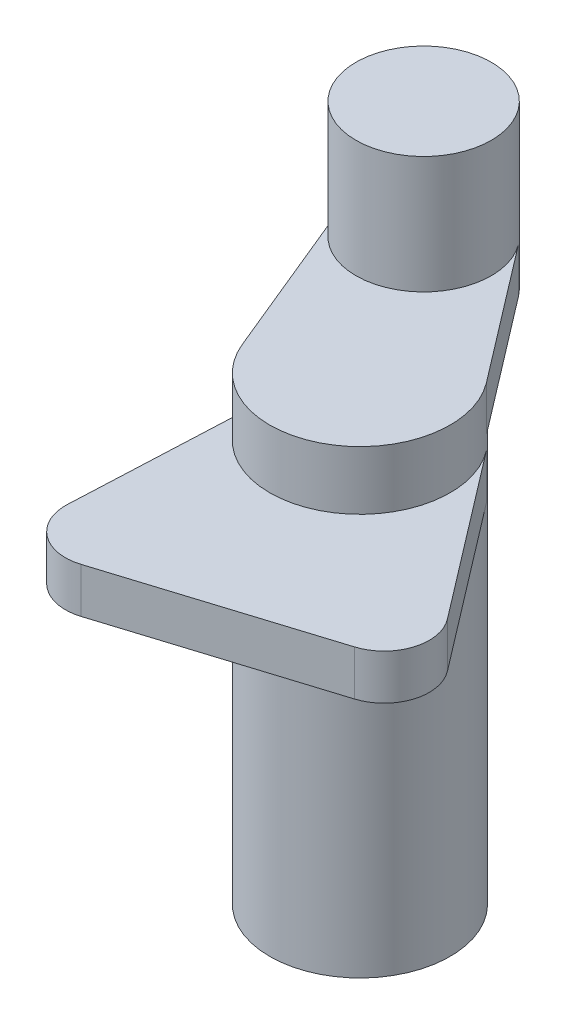
ISO-10303-21;
HEADER;
FILE_DESCRIPTION(('STEP AP214'),'2;1');
FILE_NAME('part.step','',(''),(''),'','','');
FILE_SCHEMA(('AUTOMOTIVE_DESIGN { 1 0 10303 214 1 1 1 1 }'));
ENDSEC;
DATA;
#1=APPLICATION_CONTEXT('core data for automotive mechanical design processes');
#2=APPLICATION_PROTOCOL_DEFINITION('international standard','automotive_design',2000,#1);
#3=PRODUCT_CONTEXT('',#1,'mechanical');
#4=PRODUCT('Part','Part','',(#3));
#5=PRODUCT_RELATED_PRODUCT_CATEGORY('part','',(#4));
#6=PRODUCT_DEFINITION_FORMATION('','',#4);
#7=PRODUCT_DEFINITION_CONTEXT('part definition',#1,'design');
#8=PRODUCT_DEFINITION('design','',#6,#7);
#9=PRODUCT_DEFINITION_SHAPE('','',#8);
#10=(LENGTH_UNIT() NAMED_UNIT(*) SI_UNIT(.MILLI.,.METRE.));
#11=(NAMED_UNIT(*) PLANE_ANGLE_UNIT() SI_UNIT($,.RADIAN.));
#12=(NAMED_UNIT(*) SI_UNIT($,.STERADIAN.) SOLID_ANGLE_UNIT());
#13=UNCERTAINTY_MEASURE_WITH_UNIT(LENGTH_MEASURE(1.E-05),#10,'distance_accuracy_value','');
#14=(GEOMETRIC_REPRESENTATION_CONTEXT(3) GLOBAL_UNCERTAINTY_ASSIGNED_CONTEXT((#13)) GLOBAL_UNIT_ASSIGNED_CONTEXT((#10,
#11,#12)) REPRESENTATION_CONTEXT('',''));
#15=CARTESIAN_POINT('',(0.,0.,0.));
#16=DIRECTION('',(0.,0.,1.));
#17=DIRECTION('',(1.,0.,0.));
#18=AXIS2_PLACEMENT_3D('',#15,#16,#17);
#19=CARTESIAN_POINT('',(0.,51.,0.));
#20=DIRECTION('',(0.,-1.,0.));
#21=DIRECTION('',(0.,0.,-1.));
#22=AXIS2_PLACEMENT_3D('',#19,#20,#21);
#23=CYLINDRICAL_SURFACE('',#22,20.);
#24=CARTESIAN_POINT('',(0.,41.,0.));
#25=DIRECTION('',(0.,1.,0.));
#26=DIRECTION('',(0.,0.,1.));
#27=AXIS2_PLACEMENT_3D('',#24,#25,#26);
#28=CIRCLE('',#27,20.);
#29=CARTESIAN_POINT('',(15.8895303252354,41.,-12.1458974984735));
#30=VERTEX_POINT('',#29);
#31=CARTESIAN_POINT('',(-18.4916973012162,41.,7.61952301133037));
#32=VERTEX_POINT('',#31);
#33=EDGE_CURVE('E48',#30,#32,#28,.T.);
#34=ORIENTED_EDGE('',*,*,#33,.F.);
#35=DIRECTION('',(0.,1.,0.));
#36=VECTOR('',#35,1.);
#37=CARTESIAN_POINT('',(15.8895303252354,41.,-12.1458974984735));
#38=LINE('',#37,#36);
#39=CARTESIAN_POINT('',(15.8895303252354,51.,-12.1458974984735));
#40=VERTEX_POINT('',#39);
#41=EDGE_CURVE('E224',#30,#40,#38,.T.);
#42=ORIENTED_EDGE('',*,*,#41,.T.);
#43=CARTESIAN_POINT('',(0.,51.,0.));
#44=DIRECTION('',(0.,1.,0.));
#45=DIRECTION('',(0.,0.,1.));
#46=AXIS2_PLACEMENT_3D('',#43,#44,#45);
#47=CIRCLE('',#46,20.);
#48=CARTESIAN_POINT('',(-18.4916973012162,51.,7.61952301133037));
#49=VERTEX_POINT('',#48);
#50=EDGE_CURVE('E234',#49,#40,#47,.T.);
#51=ORIENTED_EDGE('',*,*,#50,.F.);
#52=DIRECTION('',(0.,1.,0.));
#53=VECTOR('',#52,1.);
#54=CARTESIAN_POINT('',(-18.4916973012162,41.,7.61952301133037));
#55=LINE('',#54,#53);
#56=EDGE_CURVE('E228',#32,#49,#55,.T.);
#57=ORIENTED_EDGE('',*,*,#56,.F.);
#58=EDGE_LOOP('',(#34,#42,#51,#57));
#59=FACE_BOUND('',#58,.T.);
#60=CARTESIAN_POINT('',(0.,-51.,0.));
#61=DIRECTION('',(0.,1.,0.));
#62=DIRECTION('',(0.,0.,1.));
#63=AXIS2_PLACEMENT_3D('',#60,#61,#62);
#64=CIRCLE('',#63,20.);
#65=CARTESIAN_POINT('',(0.,-51.,20.));
#66=VERTEX_POINT('',#65);
#67=EDGE_CURVE('E223',#66,#66,#64,.T.);
#68=ORIENTED_EDGE('',*,*,#67,.T.);
#69=EDGE_LOOP('',(#68));
#70=FACE_BOUND('',#69,.T.);
#71=CARTESIAN_POINT('',(0.,38.,0.));
#72=DIRECTION('',(0.,1.,0.));
#73=DIRECTION('',(0.,0.,-1.));
#74=AXIS2_PLACEMENT_3D('',#71,#72,#73);
#75=CIRCLE('',#74,20.);
#76=CARTESIAN_POINT('',(-18.4916973012162,38.,7.61952301133037));
#77=VERTEX_POINT('',#76);
#78=CARTESIAN_POINT('',(15.8895303252354,38.,-12.1458974984735));
#79=VERTEX_POINT('',#78);
#80=EDGE_CURVE('E143',#77,#79,#75,.T.);
#81=ORIENTED_EDGE('',*,*,#80,.T.);
#82=DIRECTION('',(0.,-1.,0.));
#83=VECTOR('',#82,1.);
#84=CARTESIAN_POINT('',(15.8895303252354,38.,-12.1458974984735));
#85=LINE('',#84,#83);
#86=CARTESIAN_POINT('',(15.8895303252354,28.,-12.1458974984735));
#87=VERTEX_POINT('',#86);
#88=EDGE_CURVE('E126',#79,#87,#85,.T.);
#89=ORIENTED_EDGE('',*,*,#88,.T.);
#90=CARTESIAN_POINT('',(0.,28.,0.));
#91=DIRECTION('',(0.,1.,0.));
#92=DIRECTION('',(0.,0.,-1.));
#93=AXIS2_PLACEMENT_3D('',#90,#91,#92);
#94=CIRCLE('',#93,20.);
#95=CARTESIAN_POINT('',(-18.4916973012162,28.,7.61952301133037));
#96=VERTEX_POINT('',#95);
#97=EDGE_CURVE('E170',#96,#87,#94,.T.);
#98=ORIENTED_EDGE('',*,*,#97,.F.);
#99=DIRECTION('',(0.,-1.,0.));
#100=VECTOR('',#99,1.);
#101=CARTESIAN_POINT('',(-18.4916973012162,38.,7.61952301133037));
#102=LINE('',#101,#100);
#103=EDGE_CURVE('E151',#77,#96,#102,.T.);
#104=ORIENTED_EDGE('',*,*,#103,.F.);
#105=EDGE_LOOP('',(#81,#89,#98,#104));
#106=FACE_BOUND('',#105,.T.);
#107=ADVANCED_FACE('F45',(#59,#70,#106),#23,.T.);
#108=CARTESIAN_POINT('',(0.,51.,0.));
#109=DIRECTION('',(0.,1.,0.));
#110=DIRECTION('',(0.,0.,1.));
#111=AXIS2_PLACEMENT_3D('',#108,#109,#110);
#112=PLANE('',#111);
#113=CARTESIAN_POINT('',(-19.0919301378831,51.,-33.2097157039126));
#114=DIRECTION('',(0.,1.,0.));
#115=DIRECTION('',(0.,0.,1.));
#116=AXIS2_PLACEMENT_3D('',#113,#114,#115);
#117=CIRCLE('',#116,15.);
#118=CARTESIAN_POINT('',(-32.9607031137953,51.,-27.4950734454149));
#119=VERTEX_POINT('',#118);
#120=CARTESIAN_POINT('',(-7.17478239395661,51.,-42.3191388277678));
#121=VERTEX_POINT('',#120);
#122=EDGE_CURVE('E11',#119,#121,#117,.T.);
#123=ORIENTED_EDGE('',*,*,#122,.F.);
#124=DIRECTION('',(0.380976150566519,0.,0.924584865060811));
#125=VECTOR('',#124,1.);
#126=CARTESIAN_POINT('',(-18.4916973012162,51.,7.61952301133037));
#127=LINE('',#126,#125);
#128=EDGE_CURVE('E69',#119,#49,#127,.T.);
#129=ORIENTED_EDGE('',*,*,#128,.T.);
#130=ORIENTED_EDGE('',*,*,#50,.T.);
#131=DIRECTION('',(0.607294874923676,0.,0.794476516261769));
#132=VECTOR('',#131,1.);
#133=CARTESIAN_POINT('',(15.8895303252354,51.,-12.1458974984735));
#134=LINE('',#133,#132);
#135=EDGE_CURVE('E207',#121,#40,#134,.T.);
#136=ORIENTED_EDGE('',*,*,#135,.F.);
#137=EDGE_LOOP('',(#123,#129,#130,#136));
#138=FACE_BOUND('',#137,.T.);
#139=ADVANCED_FACE('F244',(#138),#112,.T.);
#140=CARTESIAN_POINT('',(0.,-51.,0.));
#141=DIRECTION('',(0.,1.,0.));
#142=DIRECTION('',(0.,0.,1.));
#143=AXIS2_PLACEMENT_3D('',#140,#141,#142);
#144=PLANE('',#143);
#145=ORIENTED_EDGE('',*,*,#67,.F.);
#146=EDGE_LOOP('',(#145));
#147=FACE_BOUND('',#146,.T.);
#148=ADVANCED_FACE('F241',(#147),#144,.F.);
#149=CARTESIAN_POINT('',(0.,41.,0.));
#150=DIRECTION('',(0.,1.,0.));
#151=DIRECTION('',(0.,0.,1.));
#152=AXIS2_PLACEMENT_3D('',#149,#150,#151);
#153=PLANE('',#152);
#154=DIRECTION('',(0.607294874923676,0.,0.794476516261769));
#155=VECTOR('',#154,1.);
#156=CARTESIAN_POINT('',(15.8895303252354,41.,-12.1458974984735));
#157=LINE('',#156,#155);
#158=CARTESIAN_POINT('',(-7.17478239395661,41.,-42.3191388277678));
#159=VERTEX_POINT('',#158);
#160=EDGE_CURVE('E211',#159,#30,#157,.T.);
#161=ORIENTED_EDGE('',*,*,#160,.T.);
#162=ORIENTED_EDGE('',*,*,#33,.T.);
#163=DIRECTION('',(0.380976150566519,0.,0.924584865060811));
#164=VECTOR('',#163,1.);
#165=CARTESIAN_POINT('',(-18.4916973012162,41.,7.61952301133037));
#166=LINE('',#165,#164);
#167=CARTESIAN_POINT('',(-32.9607031137953,41.,-27.4950734454149));
#168=VERTEX_POINT('',#167);
#169=EDGE_CURVE('E206',#168,#32,#166,.T.);
#170=ORIENTED_EDGE('',*,*,#169,.F.);
#171=CARTESIAN_POINT('',(-19.0919301378831,41.,-33.2097157039126));
#172=DIRECTION('',(0.,1.,0.));
#173=DIRECTION('',(0.,0.,1.));
#174=AXIS2_PLACEMENT_3D('',#171,#172,#173);
#175=CIRCLE('',#174,15.);
#176=EDGE_CURVE('E202',#159,#168,#175,.T.);
#177=ORIENTED_EDGE('',*,*,#176,.F.);
#178=EDGE_LOOP('',(#161,#162,#170,#177));
#179=FACE_BOUND('',#178,.T.);
#180=ADVANCED_FACE('F243',(#179),#153,.F.);
#181=CARTESIAN_POINT('',(-19.0919301378831,41.,-33.2097157039126));
#182=DIRECTION('',(0.,1.,0.));
#183=DIRECTION('',(0.,0.,1.));
#184=AXIS2_PLACEMENT_3D('',#181,#182,#183);
#185=CYLINDRICAL_SURFACE('',#184,15.);
#186=DIRECTION('',(0.,1.,0.));
#187=VECTOR('',#186,1.);
#188=CARTESIAN_POINT('',(-32.9607031137953,41.,-27.4950734454149));
#189=LINE('',#188,#187);
#190=EDGE_CURVE('E214',#168,#119,#189,.T.);
#191=ORIENTED_EDGE('',*,*,#190,.T.);
#192=ORIENTED_EDGE('',*,*,#122,.T.);
#193=DIRECTION('',(0.,1.,0.));
#194=VECTOR('',#193,1.);
#195=CARTESIAN_POINT('',(-7.17478239395661,41.,-42.3191388277678));
#196=LINE('',#195,#194);
#197=EDGE_CURVE('E219',#159,#121,#196,.T.);
#198=ORIENTED_EDGE('',*,*,#197,.F.);
#199=ORIENTED_EDGE('',*,*,#176,.T.);
#200=EDGE_LOOP('',(#191,#192,#198,#199));
#201=FACE_BOUND('',#200,.T.);
#202=CARTESIAN_POINT('',(-19.0919301378831,77.,-33.2097157039126));
#203=DIRECTION('',(0.,1.,0.));
#204=DIRECTION('',(0.,0.,1.));
#205=AXIS2_PLACEMENT_3D('',#202,#203,#204);
#206=CIRCLE('',#205,15.);
#207=CARTESIAN_POINT('',(-19.0919301378831,77.,-18.2097157039126));
#208=VERTEX_POINT('',#207);
#209=EDGE_CURVE('E187',#208,#208,#206,.T.);
#210=ORIENTED_EDGE('',*,*,#209,.F.);
#211=EDGE_LOOP('',(#210));
#212=FACE_BOUND('',#211,.T.);
#213=ADVANCED_FACE('F249',(#201,#212),#185,.T.);
#214=CARTESIAN_POINT('',(15.8895303252354,41.,-12.1458974984735));
#215=DIRECTION('',(-0.794476516261769,0.,0.607294874923676));
#216=DIRECTION('',(0.607294874923676,0.,0.794476516261769));
#217=AXIS2_PLACEMENT_3D('',#214,#215,#216);
#218=PLANE('',#217);
#219=ORIENTED_EDGE('',*,*,#135,.T.);
#220=ORIENTED_EDGE('',*,*,#41,.F.);
#221=ORIENTED_EDGE('',*,*,#160,.F.);
#222=ORIENTED_EDGE('',*,*,#197,.T.);
#223=EDGE_LOOP('',(#219,#220,#221,#222));
#224=FACE_BOUND('',#223,.T.);
#225=ADVANCED_FACE('F270',(#224),#218,.F.);
#226=CARTESIAN_POINT('',(-18.4916973012162,41.,7.61952301133037));
#227=DIRECTION('',(-0.924584865060811,0.,0.380976150566519));
#228=DIRECTION('',(0.380976150566519,0.,0.924584865060811));
#229=AXIS2_PLACEMENT_3D('',#226,#227,#228);
#230=PLANE('',#229);
#231=ORIENTED_EDGE('',*,*,#128,.F.);
#232=ORIENTED_EDGE('',*,*,#190,.F.);
#233=ORIENTED_EDGE('',*,*,#169,.T.);
#234=ORIENTED_EDGE('',*,*,#56,.T.);
#235=EDGE_LOOP('',(#231,#232,#233,#234));
#236=FACE_BOUND('',#235,.T.);
#237=ADVANCED_FACE('F266',(#236),#230,.T.);
#238=CARTESIAN_POINT('',(0.,77.,0.));
#239=DIRECTION('',(0.,1.,0.));
#240=DIRECTION('',(0.,0.,1.));
#241=AXIS2_PLACEMENT_3D('',#238,#239,#240);
#242=PLANE('',#241);
#243=ORIENTED_EDGE('',*,*,#209,.T.);
#244=EDGE_LOOP('',(#243));
#245=FACE_BOUND('',#244,.T.);
#246=ADVANCED_FACE('F277',(#245),#242,.T.);
#247=CARTESIAN_POINT('',(-18.4916973012162,38.,7.61952301133037));
#248=DIRECTION('',(-0.998965941497928,0.,-0.0454647965700774));
#249=DIRECTION('',(-0.0454647965700775,0.,0.998965941497928));
#250=AXIS2_PLACEMENT_3D('',#247,#248,#249);
#251=PLANE('',#250);
#252=DIRECTION('',(0.0454647965700774,0.,-0.998965941497928));
#253=VECTOR('',#252,1.);
#254=CARTESIAN_POINT('',(-18.4916973012162,28.,7.61952301133037));
#255=LINE('',#254,#253);
#256=CARTESIAN_POINT('',(-20.1771875382344,28.,44.6536124284726));
#257=VERTEX_POINT('',#256);
#258=EDGE_CURVE('E61',#257,#96,#255,.T.);
#259=ORIENTED_EDGE('',*,*,#258,.F.);
#260=DIRECTION('',(0.,-1.,0.));
#261=VECTOR('',#260,1.);
#262=CARTESIAN_POINT('',(-20.1771875382344,38.,44.6536124284726));
#263=LINE('',#262,#261);
#264=CARTESIAN_POINT('',(-20.1771875382344,38.,44.6536124284726));
#265=VERTEX_POINT('',#264);
#266=EDGE_CURVE('E188',#265,#257,#263,.T.);
#267=ORIENTED_EDGE('',*,*,#266,.F.);
#268=DIRECTION('',(0.0454647965700774,0.,-0.998965941497928));
#269=VECTOR('',#268,1.);
#270=CARTESIAN_POINT('',(-18.4916973012162,38.,7.61952301133037));
#271=LINE('',#270,#269);
#272=EDGE_CURVE('E137',#265,#77,#271,.T.);
#273=ORIENTED_EDGE('',*,*,#272,.T.);
#274=ORIENTED_EDGE('',*,*,#103,.T.);
#275=EDGE_LOOP('',(#259,#267,#273,#274));
#276=FACE_BOUND('',#275,.T.);
#277=ADVANCED_FACE('F283',(#276),#251,.T.);
#278=CARTESIAN_POINT('',(-10.1875281232551,38.,45.1082603941734));
#279=DIRECTION('',(0.,-1.,0.));
#280=DIRECTION('',(0.,0.,-1.));
#281=AXIS2_PLACEMENT_3D('',#278,#279,#280);
#282=CYLINDRICAL_SURFACE('',#281,10.);
#283=CARTESIAN_POINT('',(-10.1875281232551,28.,45.1082603941734));
#284=DIRECTION('',(0.,-1.,0.));
#285=DIRECTION('',(0.,0.,1.));
#286=AXIS2_PLACEMENT_3D('',#283,#284,#285);
#287=CIRCLE('',#286,10.);
#288=CARTESIAN_POINT('',(-7.19809271679358,28.,54.6509683929856));
#289=VERTEX_POINT('',#288);
#290=EDGE_CURVE('E155',#289,#257,#287,.T.);
#291=ORIENTED_EDGE('',*,*,#290,.F.);
#292=DIRECTION('',(0.,-1.,0.));
#293=VECTOR('',#292,1.);
#294=CARTESIAN_POINT('',(-7.19809271679358,38.,54.6509683929856));
#295=LINE('',#294,#293);
#296=CARTESIAN_POINT('',(-7.19809271679358,38.,54.6509683929856));
#297=VERTEX_POINT('',#296);
#298=EDGE_CURVE('E191',#297,#289,#295,.T.);
#299=ORIENTED_EDGE('',*,*,#298,.F.);
#300=CARTESIAN_POINT('',(-10.1875281232551,38.,45.1082603941734));
#301=DIRECTION('',(0.,-1.,0.));
#302=DIRECTION('',(0.,0.,1.));
#303=AXIS2_PLACEMENT_3D('',#300,#301,#302);
#304=CIRCLE('',#303,10.);
#305=EDGE_CURVE('E164',#297,#265,#304,.T.);
#306=ORIENTED_EDGE('',*,*,#305,.T.);
#307=ORIENTED_EDGE('',*,*,#266,.T.);
#308=EDGE_LOOP('',(#291,#299,#306,#307));
#309=FACE_BOUND('',#308,.T.);
#310=ADVANCED_FACE('F294',(#309),#282,.T.);
#311=CARTESIAN_POINT('',(-7.19809271679358,38.,54.6509683929856));
#312=DIRECTION('',(0.298943540646153,0.,0.954270799881219));
#313=DIRECTION('',(0.954270799881219,0.,-0.298943540646153));
#314=AXIS2_PLACEMENT_3D('',#311,#312,#313);
#315=PLANE('',#314);
#316=DIRECTION('',(-0.954270799881219,0.,0.298943540646153));
#317=VECTOR('',#316,1.);
#318=CARTESIAN_POINT('',(-7.19809271679358,28.,54.6509683929856));
#319=LINE('',#318,#317);
#320=CARTESIAN_POINT('',(38.9953614373184,28.,40.1799872613981));
#321=VERTEX_POINT('',#320);
#322=EDGE_CURVE('E179',#321,#289,#319,.T.);
#323=ORIENTED_EDGE('',*,*,#322,.F.);
#324=DIRECTION('',(0.,-1.,0.));
#325=VECTOR('',#324,1.);
#326=CARTESIAN_POINT('',(38.9953614373184,38.,40.1799872613981));
#327=LINE('',#326,#325);
#328=CARTESIAN_POINT('',(38.9953614373184,38.,40.1799872613981));
#329=VERTEX_POINT('',#328);
#330=EDGE_CURVE('E194',#329,#321,#327,.T.);
#331=ORIENTED_EDGE('',*,*,#330,.F.);
#332=DIRECTION('',(-0.954270799881219,0.,0.298943540646153));
#333=VECTOR('',#332,1.);
#334=CARTESIAN_POINT('',(-7.19809271679358,38.,54.6509683929856));
#335=LINE('',#334,#333);
#336=EDGE_CURVE('E160',#329,#297,#335,.T.);
#337=ORIENTED_EDGE('',*,*,#336,.T.);
#338=ORIENTED_EDGE('',*,*,#298,.T.);
#339=EDGE_LOOP('',(#323,#331,#337,#338));
#340=FACE_BOUND('',#339,.T.);
#341=ADVANCED_FACE('F290',(#340),#315,.T.);
#342=CARTESIAN_POINT('',(36.0059260308569,38.,30.6372792625859));
#343=DIRECTION('',(0.,-1.,0.));
#344=DIRECTION('',(0.,0.,-1.));
#345=AXIS2_PLACEMENT_3D('',#342,#343,#344);
#346=CYLINDRICAL_SURFACE('',#345,9.99999999999999);
#347=CARTESIAN_POINT('',(36.0059260308569,28.,30.6372792625859));
#348=DIRECTION('',(0.,-1.,0.));
#349=DIRECTION('',(0.,0.,1.));
#350=AXIS2_PLACEMENT_3D('',#347,#348,#349);
#351=CIRCLE('',#350,9.99999999999999);
#352=CARTESIAN_POINT('',(43.9506911934745,28.,24.5643305133491));
#353=VERTEX_POINT('',#352);
#354=EDGE_CURVE('E175',#353,#321,#351,.T.);
#355=ORIENTED_EDGE('',*,*,#354,.F.);
#356=DIRECTION('',(0.,-1.,0.));
#357=VECTOR('',#356,1.);
#358=CARTESIAN_POINT('',(43.9506911934745,38.,24.5643305133491));
#359=LINE('',#358,#357);
#360=CARTESIAN_POINT('',(43.9506911934745,38.,24.5643305133491));
#361=VERTEX_POINT('',#360);
#362=EDGE_CURVE('E136',#361,#353,#359,.T.);
#363=ORIENTED_EDGE('',*,*,#362,.F.);
#364=CARTESIAN_POINT('',(36.0059260308569,38.,30.6372792625859));
#365=DIRECTION('',(0.,-1.,0.));
#366=DIRECTION('',(0.,0.,1.));
#367=AXIS2_PLACEMENT_3D('',#364,#365,#366);
#368=CIRCLE('',#367,9.99999999999999);
#369=EDGE_CURVE('E147',#361,#329,#368,.T.);
#370=ORIENTED_EDGE('',*,*,#369,.T.);
#371=ORIENTED_EDGE('',*,*,#330,.T.);
#372=EDGE_LOOP('',(#355,#363,#370,#371));
#373=FACE_BOUND('',#372,.T.);
#374=ADVANCED_FACE('F287',(#373),#346,.T.);
#375=CARTESIAN_POINT('',(43.9506911934745,38.,24.5643305133491));
#376=DIRECTION('',(0.794476516261766,0.,-0.60729487492368));
#377=DIRECTION('',(-0.60729487492368,0.,-0.794476516261766));
#378=AXIS2_PLACEMENT_3D('',#375,#376,#377);
#379=PLANE('',#378);
#380=DIRECTION('',(0.60729487492368,0.,0.794476516261766));
#381=VECTOR('',#380,1.);
#382=CARTESIAN_POINT('',(43.9506911934745,28.,24.5643305133491));
#383=LINE('',#382,#381);
#384=EDGE_CURVE('E131',#87,#353,#383,.T.);
#385=ORIENTED_EDGE('',*,*,#384,.F.);
#386=ORIENTED_EDGE('',*,*,#88,.F.);
#387=DIRECTION('',(0.60729487492368,0.,0.794476516261766));
#388=VECTOR('',#387,1.);
#389=CARTESIAN_POINT('',(43.9506911934745,38.,24.5643305133491));
#390=LINE('',#389,#388);
#391=EDGE_CURVE('E129',#79,#361,#390,.T.);
#392=ORIENTED_EDGE('',*,*,#391,.T.);
#393=ORIENTED_EDGE('',*,*,#362,.T.);
#394=EDGE_LOOP('',(#385,#386,#392,#393));
#395=FACE_BOUND('',#394,.T.);
#396=ADVANCED_FACE('F128',(#395),#379,.T.);
#397=CARTESIAN_POINT('',(0.,38.,0.));
#398=DIRECTION('',(0.,-1.,0.));
#399=DIRECTION('',(0.,0.,-1.));
#400=AXIS2_PLACEMENT_3D('',#397,#398,#399);
#401=PLANE('',#400);
#402=ORIENTED_EDGE('',*,*,#80,.F.);
#403=ORIENTED_EDGE('',*,*,#272,.F.);
#404=ORIENTED_EDGE('',*,*,#305,.F.);
#405=ORIENTED_EDGE('',*,*,#336,.F.);
#406=ORIENTED_EDGE('',*,*,#369,.F.);
#407=ORIENTED_EDGE('',*,*,#391,.F.);
#408=EDGE_LOOP('',(#402,#403,#404,#405,#406,#407));
#409=FACE_BOUND('',#408,.T.);
#410=ADVANCED_FACE('F141',(#409),#401,.F.);
#411=CARTESIAN_POINT('',(0.,28.,0.));
#412=DIRECTION('',(0.,-1.,0.));
#413=DIRECTION('',(0.,0.,-1.));
#414=AXIS2_PLACEMENT_3D('',#411,#412,#413);
#415=PLANE('',#414);
#416=ORIENTED_EDGE('',*,*,#97,.T.);
#417=ORIENTED_EDGE('',*,*,#384,.T.);
#418=ORIENTED_EDGE('',*,*,#354,.T.);
#419=ORIENTED_EDGE('',*,*,#322,.T.);
#420=ORIENTED_EDGE('',*,*,#290,.T.);
#421=ORIENTED_EDGE('',*,*,#258,.T.);
#422=EDGE_LOOP('',(#416,#417,#418,#419,#420,#421));
#423=FACE_BOUND('',#422,.T.);
#424=ADVANCED_FACE('F302',(#423),#415,.T.);
#425=CLOSED_SHELL('',(#107,#139,#148,#180,#213,#225,#237,#246,#277,#310,#341,#374,#396,#410,#424));
#426=MANIFOLD_SOLID_BREP('B2',#425);
#427=ADVANCED_BREP_SHAPE_REPRESENTATION('',(#18,#426),#14);
#428=SHAPE_DEFINITION_REPRESENTATION(#9,#427);
ENDSEC;
END-ISO-10303-21;
